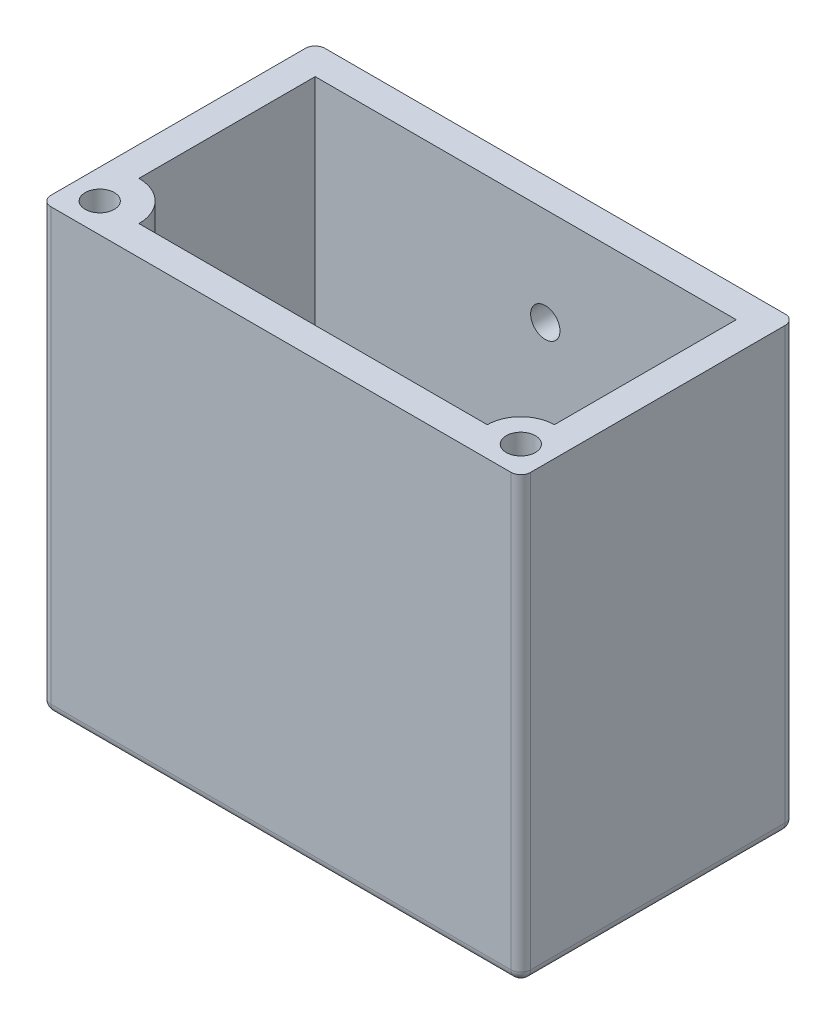
ISO-10303-21;
HEADER;
FILE_DESCRIPTION(('STEP AP214'),'2;1');
FILE_NAME('part.step','',(''),(''),'','','');
FILE_SCHEMA(('AUTOMOTIVE_DESIGN { 1 0 10303 214 1 1 1 1 }'));
ENDSEC;
DATA;
#1=APPLICATION_CONTEXT('core data for automotive mechanical design processes');
#2=APPLICATION_PROTOCOL_DEFINITION('international standard','automotive_design',2000,#1);
#3=PRODUCT_CONTEXT('',#1,'mechanical');
#4=PRODUCT('Part','Part','',(#3));
#5=PRODUCT_RELATED_PRODUCT_CATEGORY('part','',(#4));
#6=PRODUCT_DEFINITION_FORMATION('','',#4);
#7=PRODUCT_DEFINITION_CONTEXT('part definition',#1,'design');
#8=PRODUCT_DEFINITION('design','',#6,#7);
#9=PRODUCT_DEFINITION_SHAPE('','',#8);
#10=(LENGTH_UNIT() NAMED_UNIT(*) SI_UNIT(.MILLI.,.METRE.));
#11=(NAMED_UNIT(*) PLANE_ANGLE_UNIT() SI_UNIT($,.RADIAN.));
#12=(NAMED_UNIT(*) SI_UNIT($,.STERADIAN.) SOLID_ANGLE_UNIT());
#13=UNCERTAINTY_MEASURE_WITH_UNIT(LENGTH_MEASURE(1.E-05),#10,'distance_accuracy_value','');
#14=(GEOMETRIC_REPRESENTATION_CONTEXT(3) GLOBAL_UNCERTAINTY_ASSIGNED_CONTEXT((#13)) GLOBAL_UNIT_ASSIGNED_CONTEXT((#10,
#11,#12)) REPRESENTATION_CONTEXT('',''));
#15=CARTESIAN_POINT('',(0.,0.,0.));
#16=DIRECTION('',(0.,0.,1.));
#17=DIRECTION('',(1.,0.,0.));
#18=AXIS2_PLACEMENT_3D('',#15,#16,#17);
#19=CARTESIAN_POINT('',(-29.4867256637168,45.,-17.2212389380531));
#20=DIRECTION('',(1.,0.,0.));
#21=DIRECTION('',(0.,0.,-1.));
#22=AXIS2_PLACEMENT_3D('',#19,#20,#21);
#23=PLANE('',#22);
#24=DIRECTION('',(0.,0.,1.));
#25=VECTOR('',#24,1.);
#26=CARTESIAN_POINT('',(-29.4867256637168,45.,-17.2212389380531));
#27=LINE('',#26,#25);
#28=CARTESIAN_POINT('',(-29.4867256637168,45.,-16.2212389380531));
#29=VERTEX_POINT('',#28);
#30=CARTESIAN_POINT('',(-29.4867256637168,45.,9.7787610619469));
#31=VERTEX_POINT('',#30);
#32=EDGE_CURVE('E355',#29,#31,#27,.T.);
#33=ORIENTED_EDGE('',*,*,#32,.F.);
#34=DIRECTION('',(0.,-1.,0.));
#35=VECTOR('',#34,1.);
#36=CARTESIAN_POINT('',(-29.4867256637168,45.,-16.2212389380531));
#37=LINE('',#36,#35);
#38=CARTESIAN_POINT('',(-29.4867256637168,1.,-16.2212389380531));
#39=VERTEX_POINT('',#38);
#40=EDGE_CURVE('E240',#29,#39,#37,.T.);
#41=ORIENTED_EDGE('',*,*,#40,.T.);
#42=DIRECTION('',(0.,0.,1.));
#43=VECTOR('',#42,1.);
#44=CARTESIAN_POINT('',(-29.4867256637168,1.,-17.2212389380531));
#45=LINE('',#44,#43);
#46=CARTESIAN_POINT('',(-29.4867256637168,1.,9.77876106194691));
#47=VERTEX_POINT('',#46);
#48=EDGE_CURVE('E238',#39,#47,#45,.T.);
#49=ORIENTED_EDGE('',*,*,#48,.T.);
#50=DIRECTION('',(0.,-1.,0.));
#51=VECTOR('',#50,1.);
#52=CARTESIAN_POINT('',(-29.4867256637168,45.,9.77876106194691));
#53=LINE('',#52,#51);
#54=EDGE_CURVE('E236',#47,#31,#53,.F.);
#55=ORIENTED_EDGE('',*,*,#54,.T.);
#56=EDGE_LOOP('',(#33,#41,#49,#55));
#57=FACE_BOUND('',#56,.T.);
#58=ADVANCED_FACE('F37',(#57),#23,.F.);
#59=CARTESIAN_POINT('',(-29.4867256637168,45.,10.7787610619469));
#60=DIRECTION('',(0.,0.,-1.));
#61=DIRECTION('',(-1.,0.,0.));
#62=AXIS2_PLACEMENT_3D('',#59,#60,#61);
#63=PLANE('',#62);
#64=DIRECTION('',(1.,0.,0.));
#65=VECTOR('',#64,1.);
#66=CARTESIAN_POINT('',(-29.4867256637168,1.,10.7787610619469));
#67=LINE('',#66,#65);
#68=CARTESIAN_POINT('',(-28.4867256637168,1.,10.7787610619469));
#69=VERTEX_POINT('',#68);
#70=CARTESIAN_POINT('',(18.5132743362832,1.,10.7787610619469));
#71=VERTEX_POINT('',#70);
#72=EDGE_CURVE('E53',#69,#71,#67,.T.);
#73=ORIENTED_EDGE('',*,*,#72,.T.);
#74=DIRECTION('',(0.,-1.,0.));
#75=VECTOR('',#74,1.);
#76=CARTESIAN_POINT('',(18.5132743362832,45.,10.7787610619469));
#77=LINE('',#76,#75);
#78=CARTESIAN_POINT('',(18.5132743362832,45.,10.7787610619469));
#79=VERTEX_POINT('',#78);
#80=EDGE_CURVE('E11',#71,#79,#77,.F.);
#81=ORIENTED_EDGE('',*,*,#80,.T.);
#82=DIRECTION('',(1.,0.,0.));
#83=VECTOR('',#82,1.);
#84=CARTESIAN_POINT('',(-29.4867256637168,45.,10.7787610619469));
#85=LINE('',#84,#83);
#86=CARTESIAN_POINT('',(-28.4867256637168,45.,10.7787610619469));
#87=VERTEX_POINT('',#86);
#88=EDGE_CURVE('E360',#87,#79,#85,.T.);
#89=ORIENTED_EDGE('',*,*,#88,.F.);
#90=DIRECTION('',(0.,-1.,0.));
#91=VECTOR('',#90,1.);
#92=CARTESIAN_POINT('',(-28.4867256637168,45.,10.7787610619469));
#93=LINE('',#92,#91);
#94=EDGE_CURVE('E46',#87,#69,#93,.T.);
#95=ORIENTED_EDGE('',*,*,#94,.T.);
#96=EDGE_LOOP('',(#73,#81,#89,#95));
#97=FACE_BOUND('',#96,.T.);
#98=ADVANCED_FACE('F410',(#97),#63,.F.);
#99=CARTESIAN_POINT('',(19.5132743362832,45.,-17.2212389380531));
#100=DIRECTION('',(-1.,0.,0.));
#101=DIRECTION('',(0.,0.,1.));
#102=AXIS2_PLACEMENT_3D('',#99,#100,#101);
#103=PLANE('',#102);
#104=DIRECTION('',(0.,0.,-1.));
#105=VECTOR('',#104,1.);
#106=CARTESIAN_POINT('',(19.5132743362832,1.,-17.2212389380531));
#107=LINE('',#106,#105);
#108=CARTESIAN_POINT('',(19.5132743362832,1.,9.77876106194691));
#109=VERTEX_POINT('',#108);
#110=CARTESIAN_POINT('',(19.5132743362832,1.,-16.2212389380531));
#111=VERTEX_POINT('',#110);
#112=EDGE_CURVE('E202',#109,#111,#107,.T.);
#113=ORIENTED_EDGE('',*,*,#112,.T.);
#114=DIRECTION('',(0.,-1.,0.));
#115=VECTOR('',#114,1.);
#116=CARTESIAN_POINT('',(19.5132743362832,45.,-16.2212389380531));
#117=LINE('',#116,#115);
#118=CARTESIAN_POINT('',(19.5132743362832,45.,-16.2212389380531));
#119=VERTEX_POINT('',#118);
#120=EDGE_CURVE('E211',#111,#119,#117,.F.);
#121=ORIENTED_EDGE('',*,*,#120,.T.);
#122=DIRECTION('',(0.,0.,-1.));
#123=VECTOR('',#122,1.);
#124=CARTESIAN_POINT('',(19.5132743362832,45.,-17.2212389380531));
#125=LINE('',#124,#123);
#126=CARTESIAN_POINT('',(19.5132743362832,45.,9.77876106194691));
#127=VERTEX_POINT('',#126);
#128=EDGE_CURVE('E363',#127,#119,#125,.T.);
#129=ORIENTED_EDGE('',*,*,#128,.F.);
#130=DIRECTION('',(0.,-1.,0.));
#131=VECTOR('',#130,1.);
#132=CARTESIAN_POINT('',(19.5132743362832,45.,9.77876106194691));
#133=LINE('',#132,#131);
#134=EDGE_CURVE('E199',#127,#109,#133,.T.);
#135=ORIENTED_EDGE('',*,*,#134,.T.);
#136=EDGE_LOOP('',(#113,#121,#129,#135));
#137=FACE_BOUND('',#136,.T.);
#138=ADVANCED_FACE('F415',(#137),#103,.F.);
#139=CARTESIAN_POINT('',(-29.4867256637168,45.,-17.2212389380531));
#140=DIRECTION('',(0.,0.,1.));
#141=DIRECTION('',(1.,0.,0.));
#142=AXIS2_PLACEMENT_3D('',#139,#140,#141);
#143=PLANE('',#142);
#144=CARTESIAN_POINT('',(-2.98672566371681,35.,-17.2212389380531));
#145=DIRECTION('',(0.,0.,1.));
#146=DIRECTION('',(1.,0.,0.));
#147=AXIS2_PLACEMENT_3D('',#144,#145,#146);
#148=CIRCLE('',#147,1.5);
#149=CARTESIAN_POINT('',(-1.48672566371681,35.,-17.2212389380531));
#150=VERTEX_POINT('',#149);
#151=EDGE_CURVE('E303',#150,#150,#148,.T.);
#152=ORIENTED_EDGE('',*,*,#151,.T.);
#153=EDGE_LOOP('',(#152));
#154=FACE_BOUND('',#153,.T.);
#155=DIRECTION('',(-1.,0.,0.));
#156=VECTOR('',#155,1.);
#157=CARTESIAN_POINT('',(-29.4867256637168,45.,-17.2212389380531));
#158=LINE('',#157,#156);
#159=CARTESIAN_POINT('',(18.5132743362832,45.,-17.2212389380531));
#160=VERTEX_POINT('',#159);
#161=CARTESIAN_POINT('',(-28.4867256637168,45.,-17.2212389380531));
#162=VERTEX_POINT('',#161);
#163=EDGE_CURVE('E205',#160,#162,#158,.T.);
#164=ORIENTED_EDGE('',*,*,#163,.F.);
#165=DIRECTION('',(0.,-1.,0.));
#166=VECTOR('',#165,1.);
#167=CARTESIAN_POINT('',(18.5132743362832,45.,-17.2212389380531));
#168=LINE('',#167,#166);
#169=CARTESIAN_POINT('',(18.5132743362832,1.,-17.2212389380531));
#170=VERTEX_POINT('',#169);
#171=EDGE_CURVE('E226',#160,#170,#168,.T.);
#172=ORIENTED_EDGE('',*,*,#171,.T.);
#173=DIRECTION('',(-1.,0.,0.));
#174=VECTOR('',#173,1.);
#175=CARTESIAN_POINT('',(-29.4867256637168,1.,-17.2212389380531));
#176=LINE('',#175,#174);
#177=CARTESIAN_POINT('',(-28.4867256637168,1.,-17.2212389380531));
#178=VERTEX_POINT('',#177);
#179=EDGE_CURVE('E224',#170,#178,#176,.T.);
#180=ORIENTED_EDGE('',*,*,#179,.T.);
#181=DIRECTION('',(0.,-1.,0.));
#182=VECTOR('',#181,1.);
#183=CARTESIAN_POINT('',(-28.4867256637168,45.,-17.2212389380531));
#184=LINE('',#183,#182);
#185=EDGE_CURVE('E222',#178,#162,#184,.F.);
#186=ORIENTED_EDGE('',*,*,#185,.T.);
#187=EDGE_LOOP('',(#164,#172,#180,#186));
#188=FACE_BOUND('',#187,.T.);
#189=ADVANCED_FACE('F540',(#154,#188),#143,.F.);
#190=CARTESIAN_POINT('',(0.,45.,0.));
#191=DIRECTION('',(0.,1.,0.));
#192=DIRECTION('',(0.,0.,1.));
#193=AXIS2_PLACEMENT_3D('',#190,#191,#192);
#194=PLANE('',#193);
#195=CARTESIAN_POINT('',(-26.4867256637168,45.,7.77876106194691));
#196=DIRECTION('',(0.,-1.,0.));
#197=DIRECTION('',(0.,0.,-1.));
#198=AXIS2_PLACEMENT_3D('',#195,#196,#197);
#199=CIRCLE('',#198,1.49);
#200=CARTESIAN_POINT('',(-26.4867256637168,45.,6.28876106194691));
#201=VERTEX_POINT('',#200);
#202=EDGE_CURVE('E279',#201,#201,#199,.T.);
#203=ORIENTED_EDGE('',*,*,#202,.T.);
#204=EDGE_LOOP('',(#203));
#205=FACE_BOUND('',#204,.T.);
#206=DIRECTION('',(1.,0.,0.));
#207=VECTOR('',#206,1.);
#208=CARTESIAN_POINT('',(16.5132743362832,45.,7.77876106194691));
#209=LINE('',#208,#207);
#210=CARTESIAN_POINT('',(-22.4867256637168,45.,7.77876106194691));
#211=VERTEX_POINT('',#210);
#212=CARTESIAN_POINT('',(13.0915061708648,45.,7.77876106194691));
#213=VERTEX_POINT('',#212);
#214=EDGE_CURVE('E343',#211,#213,#209,.T.);
#215=ORIENTED_EDGE('',*,*,#214,.F.);
#216=CARTESIAN_POINT('',(-26.4867256637168,45.,7.77876106194691));
#217=DIRECTION('',(0.,-1.,0.));
#218=DIRECTION('',(0.,0.,-1.));
#219=AXIS2_PLACEMENT_3D('',#216,#217,#218);
#220=CIRCLE('',#219,4.);
#221=CARTESIAN_POINT('',(-26.4867256637168,45.,3.77876106194691));
#222=VERTEX_POINT('',#221);
#223=EDGE_CURVE('E195',#222,#211,#220,.T.);
#224=ORIENTED_EDGE('',*,*,#223,.F.);
#225=DIRECTION('',(0.,0.,1.));
#226=VECTOR('',#225,1.);
#227=CARTESIAN_POINT('',(-26.4867256637168,45.,7.77876106194691));
#228=LINE('',#227,#226);
#229=CARTESIAN_POINT('',(-26.4867256637168,45.,-14.2212389380531));
#230=VERTEX_POINT('',#229);
#231=EDGE_CURVE('E190',#230,#222,#228,.T.);
#232=ORIENTED_EDGE('',*,*,#231,.F.);
#233=DIRECTION('',(-1.,0.,0.));
#234=VECTOR('',#233,1.);
#235=CARTESIAN_POINT('',(16.5132743362832,45.,-14.2212389380531));
#236=LINE('',#235,#234);
#237=CARTESIAN_POINT('',(16.5132743362832,45.,-14.2212389380531));
#238=VERTEX_POINT('',#237);
#239=EDGE_CURVE('E348',#238,#230,#236,.T.);
#240=ORIENTED_EDGE('',*,*,#239,.F.);
#241=DIRECTION('',(0.,0.,-1.));
#242=VECTOR('',#241,1.);
#243=CARTESIAN_POINT('',(16.5132743362832,45.,7.77876106194691));
#244=LINE('',#243,#242);
#245=CARTESIAN_POINT('',(16.5132743362832,45.,4.35699289652851));
#246=VERTEX_POINT('',#245);
#247=EDGE_CURVE('E340',#246,#238,#244,.T.);
#248=ORIENTED_EDGE('',*,*,#247,.F.);
#249=CARTESIAN_POINT('',(16.5132743362832,45.,7.77876106194691));
#250=DIRECTION('',(0.,-1.,0.));
#251=DIRECTION('',(0.,0.,-1.));
#252=AXIS2_PLACEMENT_3D('',#249,#250,#251);
#253=CIRCLE('',#252,3.4217681654184);
#254=EDGE_CURVE('E292',#213,#246,#253,.T.);
#255=ORIENTED_EDGE('',*,*,#254,.F.);
#256=EDGE_LOOP('',(#215,#224,#232,#240,#248,#255));
#257=FACE_BOUND('',#256,.T.);
#258=ORIENTED_EDGE('',*,*,#128,.T.);
#259=CARTESIAN_POINT('',(18.5132743362832,45.,-16.2212389380531));
#260=DIRECTION('',(0.,1.,0.));
#261=DIRECTION('',(0.,0.,1.));
#262=AXIS2_PLACEMENT_3D('',#259,#260,#261);
#263=CIRCLE('',#262,1.);
#264=EDGE_CURVE('E234',#119,#160,#263,.T.);
#265=ORIENTED_EDGE('',*,*,#264,.T.);
#266=ORIENTED_EDGE('',*,*,#163,.T.);
#267=CARTESIAN_POINT('',(-28.4867256637168,45.,-16.2212389380531));
#268=DIRECTION('',(0.,1.,0.));
#269=DIRECTION('',(0.,0.,1.));
#270=AXIS2_PLACEMENT_3D('',#267,#268,#269);
#271=CIRCLE('',#270,1.);
#272=EDGE_CURVE('E232',#162,#29,#271,.T.);
#273=ORIENTED_EDGE('',*,*,#272,.T.);
#274=ORIENTED_EDGE('',*,*,#32,.T.);
#275=CARTESIAN_POINT('',(-28.4867256637168,45.,9.77876106194691));
#276=DIRECTION('',(0.,1.,0.));
#277=DIRECTION('',(0.,0.,1.));
#278=AXIS2_PLACEMENT_3D('',#275,#276,#277);
#279=CIRCLE('',#278,1.);
#280=EDGE_CURVE('E228',#31,#87,#279,.T.);
#281=ORIENTED_EDGE('',*,*,#280,.T.);
#282=ORIENTED_EDGE('',*,*,#88,.T.);
#283=CARTESIAN_POINT('',(18.5132743362832,45.,9.77876106194691));
#284=DIRECTION('',(0.,1.,0.));
#285=DIRECTION('',(0.,0.,1.));
#286=AXIS2_PLACEMENT_3D('',#283,#284,#285);
#287=CIRCLE('',#286,1.);
#288=EDGE_CURVE('E230',#79,#127,#287,.T.);
#289=ORIENTED_EDGE('',*,*,#288,.T.);
#290=EDGE_LOOP('',(#258,#265,#266,#273,#274,#281,#282,#289));
#291=FACE_BOUND('',#290,.T.);
#292=CARTESIAN_POINT('',(16.5132743362832,45.,7.77876106194691));
#293=DIRECTION('',(0.,-1.,0.));
#294=DIRECTION('',(0.,0.,-1.));
#295=AXIS2_PLACEMENT_3D('',#292,#293,#294);
#296=CIRCLE('',#295,1.49);
#297=CARTESIAN_POINT('',(16.5132743362832,45.,6.28876106194691));
#298=VERTEX_POINT('',#297);
#299=EDGE_CURVE('E289',#298,#298,#296,.T.);
#300=ORIENTED_EDGE('',*,*,#299,.T.);
#301=EDGE_LOOP('',(#300));
#302=FACE_BOUND('',#301,.T.);
#303=ADVANCED_FACE('F369',(#205,#257,#291,#302),#194,.T.);
#304=CARTESIAN_POINT('',(0.,0.,0.));
#305=DIRECTION('',(0.,1.,0.));
#306=DIRECTION('',(0.,0.,1.));
#307=AXIS2_PLACEMENT_3D('',#304,#305,#306);
#308=PLANE('',#307);
#309=DIRECTION('',(-1.,0.,0.));
#310=VECTOR('',#309,1.);
#311=CARTESIAN_POINT('',(0.,0.,-16.2212389380531));
#312=LINE('',#311,#310);
#313=CARTESIAN_POINT('',(-28.4867256637168,0.,-16.2212389380531));
#314=VERTEX_POINT('',#313);
#315=CARTESIAN_POINT('',(18.5132743362832,0.,-16.2212389380531));
#316=VERTEX_POINT('',#315);
#317=EDGE_CURVE('E217',#314,#316,#312,.F.);
#318=ORIENTED_EDGE('',*,*,#317,.T.);
#319=DIRECTION('',(0.,0.,-1.));
#320=VECTOR('',#319,1.);
#321=CARTESIAN_POINT('',(18.5132743362832,0.,0.));
#322=LINE('',#321,#320);
#323=CARTESIAN_POINT('',(18.5132743362832,0.,9.77876106194691));
#324=VERTEX_POINT('',#323);
#325=EDGE_CURVE('E219',#316,#324,#322,.F.);
#326=ORIENTED_EDGE('',*,*,#325,.T.);
#327=DIRECTION('',(1.,0.,0.));
#328=VECTOR('',#327,1.);
#329=CARTESIAN_POINT('',(0.,0.,9.77876106194691));
#330=LINE('',#329,#328);
#331=CARTESIAN_POINT('',(-28.4867256637168,0.,9.77876106194691));
#332=VERTEX_POINT('',#331);
#333=EDGE_CURVE('E213',#324,#332,#330,.F.);
#334=ORIENTED_EDGE('',*,*,#333,.T.);
#335=DIRECTION('',(0.,0.,1.));
#336=VECTOR('',#335,1.);
#337=CARTESIAN_POINT('',(-28.4867256637168,0.,0.));
#338=LINE('',#337,#336);
#339=EDGE_CURVE('E215',#332,#314,#338,.F.);
#340=ORIENTED_EDGE('',*,*,#339,.T.);
#341=EDGE_LOOP('',(#318,#326,#334,#340));
#342=FACE_BOUND('',#341,.T.);
#343=CARTESIAN_POINT('',(-26.4867256637168,0.,7.77876106194691));
#344=DIRECTION('',(0.,-1.,0.));
#345=DIRECTION('',(0.,0.,-1.));
#346=AXIS2_PLACEMENT_3D('',#343,#344,#345);
#347=CIRCLE('',#346,1.49);
#348=CARTESIAN_POINT('',(-26.4867256637168,0.,6.28876106194691));
#349=VERTEX_POINT('',#348);
#350=EDGE_CURVE('E276',#349,#349,#347,.T.);
#351=ORIENTED_EDGE('',*,*,#350,.F.);
#352=EDGE_LOOP('',(#351));
#353=FACE_BOUND('',#352,.T.);
#354=CARTESIAN_POINT('',(16.5132743362832,0.,7.77876106194691));
#355=DIRECTION('',(0.,-1.,0.));
#356=DIRECTION('',(0.,0.,-1.));
#357=AXIS2_PLACEMENT_3D('',#354,#355,#356);
#358=CIRCLE('',#357,1.49);
#359=CARTESIAN_POINT('',(16.5132743362832,0.,6.28876106194691));
#360=VERTEX_POINT('',#359);
#361=EDGE_CURVE('E288',#360,#360,#358,.T.);
#362=ORIENTED_EDGE('',*,*,#361,.F.);
#363=EDGE_LOOP('',(#362));
#364=FACE_BOUND('',#363,.T.);
#365=DIRECTION('',(1.,0.,0.));
#366=VECTOR('',#365,1.);
#367=CARTESIAN_POINT('',(0.,0.,-3.22123893805309));
#368=LINE('',#367,#366);
#369=CARTESIAN_POINT('',(-19.4867256637168,0.,-3.22123893805309));
#370=VERTEX_POINT('',#369);
#371=CARTESIAN_POINT('',(9.51327433628319,0.,-3.22123893805309));
#372=VERTEX_POINT('',#371);
#373=EDGE_CURVE('E334',#370,#372,#368,.T.);
#374=ORIENTED_EDGE('',*,*,#373,.T.);
#375=DIRECTION('',(0.,0.,-1.));
#376=VECTOR('',#375,1.);
#377=CARTESIAN_POINT('',(9.51327433628319,0.,0.));
#378=LINE('',#377,#376);
#379=CARTESIAN_POINT('',(9.51327433628319,0.,-11.2212389380531));
#380=VERTEX_POINT('',#379);
#381=EDGE_CURVE('E337',#372,#380,#378,.T.);
#382=ORIENTED_EDGE('',*,*,#381,.T.);
#383=DIRECTION('',(-1.,0.,0.));
#384=VECTOR('',#383,1.);
#385=CARTESIAN_POINT('',(0.,0.,-11.2212389380531));
#386=LINE('',#385,#384);
#387=CARTESIAN_POINT('',(-19.4867256637168,0.,-11.2212389380531));
#388=VERTEX_POINT('',#387);
#389=EDGE_CURVE('E322',#380,#388,#386,.T.);
#390=ORIENTED_EDGE('',*,*,#389,.T.);
#391=DIRECTION('',(0.,0.,1.));
#392=VECTOR('',#391,1.);
#393=CARTESIAN_POINT('',(-19.4867256637168,0.,0.));
#394=LINE('',#393,#392);
#395=EDGE_CURVE('E331',#388,#370,#394,.T.);
#396=ORIENTED_EDGE('',*,*,#395,.T.);
#397=EDGE_LOOP('',(#374,#382,#390,#396));
#398=FACE_BOUND('',#397,.T.);
#399=ADVANCED_FACE('F389',(#342,#353,#364,#398),#308,.F.);
#400=CARTESIAN_POINT('',(16.5132743362832,2.,7.77876106194691));
#401=DIRECTION('',(1.,0.,0.));
#402=DIRECTION('',(0.,0.,-1.));
#403=AXIS2_PLACEMENT_3D('',#400,#401,#402);
#404=PLANE('',#403);
#405=DIRECTION('',(0.,0.,-1.));
#406=VECTOR('',#405,1.);
#407=CARTESIAN_POINT('',(16.5132743362832,2.,7.77876106194691));
#408=LINE('',#407,#406);
#409=CARTESIAN_POINT('',(16.5132743362832,2.,4.35699289652851));
#410=VERTEX_POINT('',#409);
#411=CARTESIAN_POINT('',(16.5132743362832,2.,-14.2212389380531));
#412=VERTEX_POINT('',#411);
#413=EDGE_CURVE('E341',#410,#412,#408,.T.);
#414=ORIENTED_EDGE('',*,*,#413,.F.);
#415=DIRECTION('',(0.,-1.,0.));
#416=VECTOR('',#415,1.);
#417=CARTESIAN_POINT('',(16.5132743362832,45.,4.35699289652851));
#418=LINE('',#417,#416);
#419=EDGE_CURVE('E300',#410,#246,#418,.F.);
#420=ORIENTED_EDGE('',*,*,#419,.T.);
#421=ORIENTED_EDGE('',*,*,#247,.T.);
#422=DIRECTION('',(0.,1.,0.));
#423=VECTOR('',#422,1.);
#424=CARTESIAN_POINT('',(16.5132743362832,2.,-14.2212389380531));
#425=LINE('',#424,#423);
#426=EDGE_CURVE('E346',#412,#238,#425,.T.);
#427=ORIENTED_EDGE('',*,*,#426,.F.);
#428=EDGE_LOOP('',(#414,#420,#421,#427));
#429=FACE_BOUND('',#428,.T.);
#430=ADVANCED_FACE('F570',(#429),#404,.F.);
#431=CARTESIAN_POINT('',(16.5132743362832,2.,7.77876106194691));
#432=DIRECTION('',(0.,0.,1.));
#433=DIRECTION('',(1.,0.,0.));
#434=AXIS2_PLACEMENT_3D('',#431,#432,#433);
#435=PLANE('',#434);
#436=DIRECTION('',(1.,0.,0.));
#437=VECTOR('',#436,1.);
#438=CARTESIAN_POINT('',(16.5132743362832,2.,7.77876106194691));
#439=LINE('',#438,#437);
#440=CARTESIAN_POINT('',(-22.4867256637168,2.,7.77876106194691));
#441=VERTEX_POINT('',#440);
#442=CARTESIAN_POINT('',(13.0915061708648,2.,7.77876106194691));
#443=VERTEX_POINT('',#442);
#444=EDGE_CURVE('E184',#441,#443,#439,.T.);
#445=ORIENTED_EDGE('',*,*,#444,.F.);
#446=DIRECTION('',(0.,-1.,0.));
#447=VECTOR('',#446,1.);
#448=CARTESIAN_POINT('',(-22.4867256637168,45.,7.77876106194691));
#449=LINE('',#448,#447);
#450=EDGE_CURVE('E194',#441,#211,#449,.F.);
#451=ORIENTED_EDGE('',*,*,#450,.T.);
#452=ORIENTED_EDGE('',*,*,#214,.T.);
#453=DIRECTION('',(0.,-1.,0.));
#454=VECTOR('',#453,1.);
#455=CARTESIAN_POINT('',(13.0915061708648,45.,7.77876106194691));
#456=LINE('',#455,#454);
#457=EDGE_CURVE('E297',#213,#443,#456,.T.);
#458=ORIENTED_EDGE('',*,*,#457,.T.);
#459=EDGE_LOOP('',(#445,#451,#452,#458));
#460=FACE_BOUND('',#459,.T.);
#461=ADVANCED_FACE('F575',(#460),#435,.F.);
#462=CARTESIAN_POINT('',(-26.4867256637168,2.,7.77876106194691));
#463=DIRECTION('',(-1.,0.,0.));
#464=DIRECTION('',(0.,0.,1.));
#465=AXIS2_PLACEMENT_3D('',#462,#463,#464);
#466=PLANE('',#465);
#467=ORIENTED_EDGE('',*,*,#231,.T.);
#468=DIRECTION('',(0.,-1.,0.));
#469=VECTOR('',#468,1.);
#470=CARTESIAN_POINT('',(-26.4867256637168,45.,3.77876106194691));
#471=LINE('',#470,#469);
#472=CARTESIAN_POINT('',(-26.4867256637168,2.,3.77876106194691));
#473=VERTEX_POINT('',#472);
#474=EDGE_CURVE('E187',#222,#473,#471,.T.);
#475=ORIENTED_EDGE('',*,*,#474,.T.);
#476=DIRECTION('',(0.,0.,1.));
#477=VECTOR('',#476,1.);
#478=CARTESIAN_POINT('',(-26.4867256637168,2.,7.77876106194691));
#479=LINE('',#478,#477);
#480=CARTESIAN_POINT('',(-26.4867256637168,2.,-14.2212389380531));
#481=VERTEX_POINT('',#480);
#482=EDGE_CURVE('E174',#481,#473,#479,.T.);
#483=ORIENTED_EDGE('',*,*,#482,.F.);
#484=DIRECTION('',(0.,1.,0.));
#485=VECTOR('',#484,1.);
#486=CARTESIAN_POINT('',(-26.4867256637168,2.,-14.2212389380531));
#487=LINE('',#486,#485);
#488=EDGE_CURVE('E353',#481,#230,#487,.T.);
#489=ORIENTED_EDGE('',*,*,#488,.T.);
#490=EDGE_LOOP('',(#467,#475,#483,#489));
#491=FACE_BOUND('',#490,.T.);
#492=ADVANCED_FACE('F188',(#491),#466,.F.);
#493=CARTESIAN_POINT('',(16.5132743362832,2.,-14.2212389380531));
#494=DIRECTION('',(0.,0.,-1.));
#495=DIRECTION('',(-1.,0.,0.));
#496=AXIS2_PLACEMENT_3D('',#493,#494,#495);
#497=PLANE('',#496);
#498=CARTESIAN_POINT('',(-2.98672566371681,35.,-14.2212389380531));
#499=DIRECTION('',(0.,0.,1.));
#500=DIRECTION('',(1.,0.,0.));
#501=AXIS2_PLACEMENT_3D('',#498,#499,#500);
#502=CIRCLE('',#501,1.5);
#503=CARTESIAN_POINT('',(-1.48672566371681,35.,-14.2212389380531));
#504=VERTEX_POINT('',#503);
#505=EDGE_CURVE('E302',#504,#504,#502,.T.);
#506=ORIENTED_EDGE('',*,*,#505,.F.);
#507=EDGE_LOOP('',(#506));
#508=FACE_BOUND('',#507,.T.);
#509=ORIENTED_EDGE('',*,*,#239,.T.);
#510=ORIENTED_EDGE('',*,*,#488,.F.);
#511=DIRECTION('',(-1.,0.,0.));
#512=VECTOR('',#511,1.);
#513=CARTESIAN_POINT('',(16.5132743362832,2.,-14.2212389380531));
#514=LINE('',#513,#512);
#515=EDGE_CURVE('E182',#412,#481,#514,.T.);
#516=ORIENTED_EDGE('',*,*,#515,.F.);
#517=ORIENTED_EDGE('',*,*,#426,.T.);
#518=EDGE_LOOP('',(#509,#510,#516,#517));
#519=FACE_BOUND('',#518,.T.);
#520=ADVANCED_FACE('F595',(#508,#519),#497,.F.);
#521=CARTESIAN_POINT('',(0.,2.,0.));
#522=DIRECTION('',(0.,1.,0.));
#523=DIRECTION('',(0.,0.,1.));
#524=AXIS2_PLACEMENT_3D('',#521,#522,#523);
#525=PLANE('',#524);
#526=CARTESIAN_POINT('',(-26.4867256637168,2.,7.77876106194691));
#527=DIRECTION('',(0.,1.,0.));
#528=DIRECTION('',(0.,0.,1.));
#529=AXIS2_PLACEMENT_3D('',#526,#527,#528);
#530=CIRCLE('',#529,4.);
#531=EDGE_CURVE('E179',#441,#473,#530,.T.);
#532=ORIENTED_EDGE('',*,*,#531,.F.);
#533=ORIENTED_EDGE('',*,*,#444,.T.);
#534=CARTESIAN_POINT('',(16.5132743362832,2.,7.77876106194691));
#535=DIRECTION('',(0.,1.,0.));
#536=DIRECTION('',(0.,0.,1.));
#537=AXIS2_PLACEMENT_3D('',#534,#535,#536);
#538=CIRCLE('',#537,3.4217681654184);
#539=EDGE_CURVE('E200',#410,#443,#538,.T.);
#540=ORIENTED_EDGE('',*,*,#539,.F.);
#541=ORIENTED_EDGE('',*,*,#413,.T.);
#542=ORIENTED_EDGE('',*,*,#515,.T.);
#543=ORIENTED_EDGE('',*,*,#482,.T.);
#544=EDGE_LOOP('',(#532,#533,#540,#541,#542,#543));
#545=FACE_BOUND('',#544,.T.);
#546=DIRECTION('',(0.,0.,-1.));
#547=VECTOR('',#546,1.);
#548=CARTESIAN_POINT('',(9.51327433628319,2.,-3.22123893805309));
#549=LINE('',#548,#547);
#550=CARTESIAN_POINT('',(9.51327433628319,2.,-3.22123893805309));
#551=VERTEX_POINT('',#550);
#552=CARTESIAN_POINT('',(9.51327433628319,2.,-11.2212389380531));
#553=VERTEX_POINT('',#552);
#554=EDGE_CURVE('E306',#551,#553,#549,.T.);
#555=ORIENTED_EDGE('',*,*,#554,.F.);
#556=DIRECTION('',(1.,0.,0.));
#557=VECTOR('',#556,1.);
#558=CARTESIAN_POINT('',(9.51327433628319,2.,-3.22123893805309));
#559=LINE('',#558,#557);
#560=CARTESIAN_POINT('',(-19.4867256637168,2.,-3.22123893805309));
#561=VERTEX_POINT('',#560);
#562=EDGE_CURVE('E316',#561,#551,#559,.T.);
#563=ORIENTED_EDGE('',*,*,#562,.F.);
#564=DIRECTION('',(0.,0.,1.));
#565=VECTOR('',#564,1.);
#566=CARTESIAN_POINT('',(-19.4867256637168,2.,-3.22123893805309));
#567=LINE('',#566,#565);
#568=CARTESIAN_POINT('',(-19.4867256637168,2.,-11.2212389380531));
#569=VERTEX_POINT('',#568);
#570=EDGE_CURVE('E313',#569,#561,#567,.T.);
#571=ORIENTED_EDGE('',*,*,#570,.F.);
#572=DIRECTION('',(-1.,0.,0.));
#573=VECTOR('',#572,1.);
#574=CARTESIAN_POINT('',(9.51327433628319,2.,-11.2212389380531));
#575=LINE('',#574,#573);
#576=EDGE_CURVE('E310',#553,#569,#575,.T.);
#577=ORIENTED_EDGE('',*,*,#576,.F.);
#578=EDGE_LOOP('',(#555,#563,#571,#577));
#579=FACE_BOUND('',#578,.T.);
#580=ADVANCED_FACE('F176',(#545,#579),#525,.T.);
#581=CARTESIAN_POINT('',(9.51327433628319,-0.999999999999998,-3.22123893805309));
#582=DIRECTION('',(1.,0.,0.));
#583=DIRECTION('',(0.,0.,-1.));
#584=AXIS2_PLACEMENT_3D('',#581,#582,#583);
#585=PLANE('',#584);
#586=DIRECTION('',(0.,1.,0.));
#587=VECTOR('',#586,1.);
#588=CARTESIAN_POINT('',(9.51327433628319,-0.999999999999998,-3.22123893805309));
#589=LINE('',#588,#587);
#590=EDGE_CURVE('E320',#372,#551,#589,.T.);
#591=ORIENTED_EDGE('',*,*,#590,.T.);
#592=ORIENTED_EDGE('',*,*,#554,.T.);
#593=DIRECTION('',(0.,1.,0.));
#594=VECTOR('',#593,1.);
#595=CARTESIAN_POINT('',(9.51327433628319,-0.999999999999998,-11.2212389380531));
#596=LINE('',#595,#594);
#597=EDGE_CURVE('E319',#380,#553,#596,.T.);
#598=ORIENTED_EDGE('',*,*,#597,.F.);
#599=ORIENTED_EDGE('',*,*,#381,.F.);
#600=EDGE_LOOP('',(#591,#592,#598,#599));
#601=FACE_BOUND('',#600,.T.);
#602=ADVANCED_FACE('F631',(#601),#585,.F.);
#603=CARTESIAN_POINT('',(9.51327433628319,-0.999999999999998,-3.22123893805309));
#604=DIRECTION('',(0.,0.,1.));
#605=DIRECTION('',(1.,0.,0.));
#606=AXIS2_PLACEMENT_3D('',#603,#604,#605);
#607=PLANE('',#606);
#608=DIRECTION('',(0.,1.,0.));
#609=VECTOR('',#608,1.);
#610=CARTESIAN_POINT('',(-19.4867256637168,-0.999999999999998,-3.22123893805309));
#611=LINE('',#610,#609);
#612=EDGE_CURVE('E323',#370,#561,#611,.T.);
#613=ORIENTED_EDGE('',*,*,#612,.T.);
#614=ORIENTED_EDGE('',*,*,#562,.T.);
#615=ORIENTED_EDGE('',*,*,#590,.F.);
#616=ORIENTED_EDGE('',*,*,#373,.F.);
#617=EDGE_LOOP('',(#613,#614,#615,#616));
#618=FACE_BOUND('',#617,.T.);
#619=ADVANCED_FACE('F621',(#618),#607,.F.);
#620=CARTESIAN_POINT('',(-19.4867256637168,-0.999999999999998,-3.22123893805309));
#621=DIRECTION('',(-1.,0.,0.));
#622=DIRECTION('',(0.,0.,1.));
#623=AXIS2_PLACEMENT_3D('',#620,#621,#622);
#624=PLANE('',#623);
#625=DIRECTION('',(0.,1.,0.));
#626=VECTOR('',#625,1.);
#627=CARTESIAN_POINT('',(-19.4867256637168,-0.999999999999998,-11.2212389380531));
#628=LINE('',#627,#626);
#629=EDGE_CURVE('E325',#388,#569,#628,.T.);
#630=ORIENTED_EDGE('',*,*,#629,.T.);
#631=ORIENTED_EDGE('',*,*,#570,.T.);
#632=ORIENTED_EDGE('',*,*,#612,.F.);
#633=ORIENTED_EDGE('',*,*,#395,.F.);
#634=EDGE_LOOP('',(#630,#631,#632,#633));
#635=FACE_BOUND('',#634,.T.);
#636=ADVANCED_FACE('F611',(#635),#624,.F.);
#637=CARTESIAN_POINT('',(9.51327433628319,-0.999999999999998,-11.2212389380531));
#638=DIRECTION('',(0.,0.,-1.));
#639=DIRECTION('',(-1.,0.,0.));
#640=AXIS2_PLACEMENT_3D('',#637,#638,#639);
#641=PLANE('',#640);
#642=ORIENTED_EDGE('',*,*,#597,.T.);
#643=ORIENTED_EDGE('',*,*,#576,.T.);
#644=ORIENTED_EDGE('',*,*,#629,.F.);
#645=ORIENTED_EDGE('',*,*,#389,.F.);
#646=EDGE_LOOP('',(#642,#643,#644,#645));
#647=FACE_BOUND('',#646,.T.);
#648=ADVANCED_FACE('F587',(#647),#641,.F.);
#649=CARTESIAN_POINT('',(-2.98672566371681,35.,-17.2212389380531));
#650=DIRECTION('',(0.,0.,1.));
#651=DIRECTION('',(1.,0.,0.));
#652=AXIS2_PLACEMENT_3D('',#649,#650,#651);
#653=CYLINDRICAL_SURFACE('',#652,1.5);
#654=ORIENTED_EDGE('',*,*,#151,.F.);
#655=EDGE_LOOP('',(#654));
#656=FACE_BOUND('',#655,.T.);
#657=ORIENTED_EDGE('',*,*,#505,.T.);
#658=EDGE_LOOP('',(#657));
#659=FACE_BOUND('',#658,.T.);
#660=ADVANCED_FACE('F563',(#656,#659),#653,.F.);
#661=CARTESIAN_POINT('',(16.5132743362832,45.,7.77876106194691));
#662=DIRECTION('',(0.,-1.,0.));
#663=DIRECTION('',(0.,0.,-1.));
#664=AXIS2_PLACEMENT_3D('',#661,#662,#663);
#665=CYLINDRICAL_SURFACE('',#664,3.4217681654184);
#666=ORIENTED_EDGE('',*,*,#419,.F.);
#667=ORIENTED_EDGE('',*,*,#539,.T.);
#668=ORIENTED_EDGE('',*,*,#457,.F.);
#669=ORIENTED_EDGE('',*,*,#254,.T.);
#670=EDGE_LOOP('',(#666,#667,#668,#669));
#671=FACE_BOUND('',#670,.T.);
#672=ADVANCED_FACE('F554',(#671),#665,.T.);
#673=CARTESIAN_POINT('',(16.5132743362832,45.,7.77876106194691));
#674=DIRECTION('',(0.,-1.,0.));
#675=DIRECTION('',(0.,0.,-1.));
#676=AXIS2_PLACEMENT_3D('',#673,#674,#675);
#677=CYLINDRICAL_SURFACE('',#676,1.49);
#678=ORIENTED_EDGE('',*,*,#299,.F.);
#679=EDGE_LOOP('',(#678));
#680=FACE_BOUND('',#679,.T.);
#681=ORIENTED_EDGE('',*,*,#361,.T.);
#682=EDGE_LOOP('',(#681));
#683=FACE_BOUND('',#682,.T.);
#684=ADVANCED_FACE('F530',(#680,#683),#677,.F.);
#685=CARTESIAN_POINT('',(-26.4867256637168,45.,7.77876106194691));
#686=DIRECTION('',(0.,-1.,0.));
#687=DIRECTION('',(0.,0.,-1.));
#688=AXIS2_PLACEMENT_3D('',#685,#686,#687);
#689=CYLINDRICAL_SURFACE('',#688,4.);
#690=ORIENTED_EDGE('',*,*,#450,.F.);
#691=ORIENTED_EDGE('',*,*,#531,.T.);
#692=ORIENTED_EDGE('',*,*,#474,.F.);
#693=ORIENTED_EDGE('',*,*,#223,.T.);
#694=EDGE_LOOP('',(#690,#691,#692,#693));
#695=FACE_BOUND('',#694,.T.);
#696=ADVANCED_FACE('F198',(#695),#689,.T.);
#697=CARTESIAN_POINT('',(-26.4867256637168,45.,7.77876106194691));
#698=DIRECTION('',(0.,-1.,0.));
#699=DIRECTION('',(0.,0.,-1.));
#700=AXIS2_PLACEMENT_3D('',#697,#698,#699);
#701=CYLINDRICAL_SURFACE('',#700,1.49);
#702=ORIENTED_EDGE('',*,*,#202,.F.);
#703=EDGE_LOOP('',(#702));
#704=FACE_BOUND('',#703,.T.);
#705=ORIENTED_EDGE('',*,*,#350,.T.);
#706=EDGE_LOOP('',(#705));
#707=FACE_BOUND('',#706,.T.);
#708=ADVANCED_FACE('F513',(#704,#707),#701,.F.);
#709=CARTESIAN_POINT('',(-28.4867256637168,45.,9.77876106194691));
#710=DIRECTION('',(0.,-1.,0.));
#711=DIRECTION('',(0.,0.,-1.));
#712=AXIS2_PLACEMENT_3D('',#709,#710,#711);
#713=CYLINDRICAL_SURFACE('',#712,1.);
#714=ORIENTED_EDGE('',*,*,#280,.F.);
#715=ORIENTED_EDGE('',*,*,#54,.F.);
#716=CARTESIAN_POINT('',(-28.4867256637168,1.,9.77876106194691));
#717=DIRECTION('',(0.,-1.,0.));
#718=DIRECTION('',(0.,0.,-1.));
#719=AXIS2_PLACEMENT_3D('',#716,#717,#718);
#720=CIRCLE('',#719,1.);
#721=EDGE_CURVE('E271',#69,#47,#720,.T.);
#722=ORIENTED_EDGE('',*,*,#721,.F.);
#723=ORIENTED_EDGE('',*,*,#94,.F.);
#724=EDGE_LOOP('',(#714,#715,#722,#723));
#725=FACE_BOUND('',#724,.T.);
#726=ADVANCED_FACE('F39',(#725),#713,.T.);
#727=CARTESIAN_POINT('',(-28.4867256637168,45.,-16.2212389380531));
#728=DIRECTION('',(0.,-1.,0.));
#729=DIRECTION('',(0.,0.,-1.));
#730=AXIS2_PLACEMENT_3D('',#727,#728,#729);
#731=CYLINDRICAL_SURFACE('',#730,1.);
#732=ORIENTED_EDGE('',*,*,#272,.F.);
#733=ORIENTED_EDGE('',*,*,#185,.F.);
#734=CARTESIAN_POINT('',(-28.4867256637168,1.,-16.2212389380531));
#735=DIRECTION('',(0.,-1.,0.));
#736=DIRECTION('',(0.,0.,-1.));
#737=AXIS2_PLACEMENT_3D('',#734,#735,#736);
#738=CIRCLE('',#737,1.);
#739=EDGE_CURVE('E269',#39,#178,#738,.T.);
#740=ORIENTED_EDGE('',*,*,#739,.F.);
#741=ORIENTED_EDGE('',*,*,#40,.F.);
#742=EDGE_LOOP('',(#732,#733,#740,#741));
#743=FACE_BOUND('',#742,.T.);
#744=ADVANCED_FACE('F378',(#743),#731,.T.);
#745=CARTESIAN_POINT('',(-28.4867256637168,1.,-17.2212389380531));
#746=DIRECTION('',(0.,0.,1.));
#747=DIRECTION('',(1.,0.,0.));
#748=AXIS2_PLACEMENT_3D('',#745,#746,#747);
#749=CYLINDRICAL_SURFACE('',#748,1.);
#750=CARTESIAN_POINT('',(-28.4867256637168,1.,9.77876106194691));
#751=DIRECTION('',(0.,0.,1.));
#752=DIRECTION('',(1.,0.,0.));
#753=AXIS2_PLACEMENT_3D('',#750,#751,#752);
#754=CIRCLE('',#753,1.);
#755=EDGE_CURVE('E41',#47,#332,#754,.T.);
#756=ORIENTED_EDGE('',*,*,#755,.F.);
#757=ORIENTED_EDGE('',*,*,#48,.F.);
#758=CARTESIAN_POINT('',(-28.4867256637168,1.,-16.2212389380531));
#759=DIRECTION('',(0.,0.,-1.));
#760=DIRECTION('',(-1.,0.,0.));
#761=AXIS2_PLACEMENT_3D('',#758,#759,#760);
#762=CIRCLE('',#761,1.);
#763=EDGE_CURVE('E266',#314,#39,#762,.T.);
#764=ORIENTED_EDGE('',*,*,#763,.F.);
#765=ORIENTED_EDGE('',*,*,#339,.F.);
#766=EDGE_LOOP('',(#756,#757,#764,#765));
#767=FACE_BOUND('',#766,.T.);
#768=ADVANCED_FACE('F385',(#767),#749,.T.);
#769=CARTESIAN_POINT('',(-28.4867256637168,1.,9.77876106194691));
#770=DIRECTION('',(0.,0.,1.));
#771=DIRECTION('',(1.,0.,0.));
#772=AXIS2_PLACEMENT_3D('',#769,#770,#771);
#773=SPHERICAL_SURFACE('',#772,1.);
#774=ORIENTED_EDGE('',*,*,#721,.T.);
#775=ORIENTED_EDGE('',*,*,#755,.T.);
#776=CARTESIAN_POINT('',(-28.4867256637168,1.,9.77876106194691));
#777=DIRECTION('',(-1.,0.,0.));
#778=DIRECTION('',(0.,0.,1.));
#779=AXIS2_PLACEMENT_3D('',#776,#777,#778);
#780=CIRCLE('',#779,1.);
#781=EDGE_CURVE('E263',#69,#332,#780,.F.);
#782=ORIENTED_EDGE('',*,*,#781,.F.);
#783=EDGE_LOOP('',(#774,#775,#782));
#784=FACE_BOUND('',#783,.T.);
#785=ADVANCED_FACE('F398',(#784),#773,.T.);
#786=CARTESIAN_POINT('',(-28.4867256637168,1.,-16.2212389380531));
#787=DIRECTION('',(0.,0.,1.));
#788=DIRECTION('',(1.,0.,0.));
#789=AXIS2_PLACEMENT_3D('',#786,#787,#788);
#790=SPHERICAL_SURFACE('',#789,1.);
#791=ORIENTED_EDGE('',*,*,#763,.T.);
#792=ORIENTED_EDGE('',*,*,#739,.T.);
#793=CARTESIAN_POINT('',(-28.4867256637168,1.,-16.2212389380531));
#794=DIRECTION('',(-1.,0.,0.));
#795=DIRECTION('',(0.,0.,1.));
#796=AXIS2_PLACEMENT_3D('',#793,#794,#795);
#797=CIRCLE('',#796,1.);
#798=EDGE_CURVE('E260',#314,#178,#797,.F.);
#799=ORIENTED_EDGE('',*,*,#798,.F.);
#800=EDGE_LOOP('',(#791,#792,#799));
#801=FACE_BOUND('',#800,.T.);
#802=ADVANCED_FACE('F400',(#801),#790,.T.);
#803=CARTESIAN_POINT('',(-29.4867256637168,1.,9.77876106194691));
#804=DIRECTION('',(1.,0.,0.));
#805=DIRECTION('',(0.,0.,-1.));
#806=AXIS2_PLACEMENT_3D('',#803,#804,#805);
#807=CYLINDRICAL_SURFACE('',#806,1.);
#808=ORIENTED_EDGE('',*,*,#781,.T.);
#809=ORIENTED_EDGE('',*,*,#333,.F.);
#810=CARTESIAN_POINT('',(18.5132743362832,1.,9.77876106194691));
#811=DIRECTION('',(1.,0.,0.));
#812=DIRECTION('',(0.,0.,-1.));
#813=AXIS2_PLACEMENT_3D('',#810,#811,#812);
#814=CIRCLE('',#813,1.);
#815=EDGE_CURVE('E257',#71,#324,#814,.T.);
#816=ORIENTED_EDGE('',*,*,#815,.F.);
#817=ORIENTED_EDGE('',*,*,#72,.F.);
#818=EDGE_LOOP('',(#808,#809,#816,#817));
#819=FACE_BOUND('',#818,.T.);
#820=ADVANCED_FACE('F397',(#819),#807,.T.);
#821=CARTESIAN_POINT('',(18.5132743362832,45.,9.77876106194691));
#822=DIRECTION('',(0.,-1.,0.));
#823=DIRECTION('',(0.,0.,-1.));
#824=AXIS2_PLACEMENT_3D('',#821,#822,#823);
#825=CYLINDRICAL_SURFACE('',#824,1.);
#826=ORIENTED_EDGE('',*,*,#288,.F.);
#827=ORIENTED_EDGE('',*,*,#80,.F.);
#828=CARTESIAN_POINT('',(18.5132743362832,1.,9.77876106194691));
#829=DIRECTION('',(0.,-1.,0.));
#830=DIRECTION('',(0.,0.,-1.));
#831=AXIS2_PLACEMENT_3D('',#828,#829,#830);
#832=CIRCLE('',#831,1.);
#833=EDGE_CURVE('E254',#109,#71,#832,.T.);
#834=ORIENTED_EDGE('',*,*,#833,.F.);
#835=ORIENTED_EDGE('',*,*,#134,.F.);
#836=EDGE_LOOP('',(#826,#827,#834,#835));
#837=FACE_BOUND('',#836,.T.);
#838=ADVANCED_FACE('F438',(#837),#825,.T.);
#839=CARTESIAN_POINT('',(18.5132743362832,45.,-16.2212389380531));
#840=DIRECTION('',(0.,-1.,0.));
#841=DIRECTION('',(0.,0.,-1.));
#842=AXIS2_PLACEMENT_3D('',#839,#840,#841);
#843=CYLINDRICAL_SURFACE('',#842,1.);
#844=ORIENTED_EDGE('',*,*,#264,.F.);
#845=ORIENTED_EDGE('',*,*,#120,.F.);
#846=CARTESIAN_POINT('',(18.5132743362832,1.,-16.2212389380531));
#847=DIRECTION('',(0.,-1.,0.));
#848=DIRECTION('',(0.,0.,-1.));
#849=AXIS2_PLACEMENT_3D('',#846,#847,#848);
#850=CIRCLE('',#849,1.);
#851=EDGE_CURVE('E251',#170,#111,#850,.T.);
#852=ORIENTED_EDGE('',*,*,#851,.F.);
#853=ORIENTED_EDGE('',*,*,#171,.F.);
#854=EDGE_LOOP('',(#844,#845,#852,#853));
#855=FACE_BOUND('',#854,.T.);
#856=ADVANCED_FACE('F434',(#855),#843,.T.);
#857=CARTESIAN_POINT('',(-29.4867256637168,1.,-16.2212389380531));
#858=DIRECTION('',(-1.,0.,0.));
#859=DIRECTION('',(0.,0.,1.));
#860=AXIS2_PLACEMENT_3D('',#857,#858,#859);
#861=CYLINDRICAL_SURFACE('',#860,1.);
#862=ORIENTED_EDGE('',*,*,#798,.T.);
#863=ORIENTED_EDGE('',*,*,#179,.F.);
#864=CARTESIAN_POINT('',(18.5132743362832,1.,-16.2212389380531));
#865=DIRECTION('',(1.,0.,0.));
#866=DIRECTION('',(0.,0.,-1.));
#867=AXIS2_PLACEMENT_3D('',#864,#865,#866);
#868=CIRCLE('',#867,1.);
#869=EDGE_CURVE('E248',#316,#170,#868,.T.);
#870=ORIENTED_EDGE('',*,*,#869,.F.);
#871=ORIENTED_EDGE('',*,*,#317,.F.);
#872=EDGE_LOOP('',(#862,#863,#870,#871));
#873=FACE_BOUND('',#872,.T.);
#874=ADVANCED_FACE('F430',(#873),#861,.T.);
#875=CARTESIAN_POINT('',(18.5132743362832,1.,9.77876106194691));
#876=DIRECTION('',(0.,0.,1.));
#877=DIRECTION('',(1.,0.,0.));
#878=AXIS2_PLACEMENT_3D('',#875,#876,#877);
#879=SPHERICAL_SURFACE('',#878,1.);
#880=ORIENTED_EDGE('',*,*,#833,.T.);
#881=ORIENTED_EDGE('',*,*,#815,.T.);
#882=CARTESIAN_POINT('',(18.5132743362832,1.,9.77876106194691));
#883=DIRECTION('',(0.,0.,1.));
#884=DIRECTION('',(1.,0.,0.));
#885=AXIS2_PLACEMENT_3D('',#882,#883,#884);
#886=CIRCLE('',#885,1.);
#887=EDGE_CURVE('E246',#109,#324,#886,.F.);
#888=ORIENTED_EDGE('',*,*,#887,.F.);
#889=EDGE_LOOP('',(#880,#881,#888));
#890=FACE_BOUND('',#889,.T.);
#891=ADVANCED_FACE('F426',(#890),#879,.T.);
#892=CARTESIAN_POINT('',(18.5132743362832,1.,-16.2212389380531));
#893=DIRECTION('',(0.,0.,1.));
#894=DIRECTION('',(1.,0.,0.));
#895=AXIS2_PLACEMENT_3D('',#892,#893,#894);
#896=SPHERICAL_SURFACE('',#895,1.);
#897=ORIENTED_EDGE('',*,*,#869,.T.);
#898=ORIENTED_EDGE('',*,*,#851,.T.);
#899=CARTESIAN_POINT('',(18.5132743362832,1.,-16.2212389380531));
#900=DIRECTION('',(0.,0.,-1.));
#901=DIRECTION('',(-1.,0.,0.));
#902=AXIS2_PLACEMENT_3D('',#899,#900,#901);
#903=CIRCLE('',#902,1.);
#904=EDGE_CURVE('E244',#316,#111,#903,.F.);
#905=ORIENTED_EDGE('',*,*,#904,.F.);
#906=EDGE_LOOP('',(#897,#898,#905));
#907=FACE_BOUND('',#906,.T.);
#908=ADVANCED_FACE('F422',(#907),#896,.T.);
#909=CARTESIAN_POINT('',(18.5132743362832,1.,-17.2212389380531));
#910=DIRECTION('',(0.,0.,-1.));
#911=DIRECTION('',(-1.,0.,0.));
#912=AXIS2_PLACEMENT_3D('',#909,#910,#911);
#913=CYLINDRICAL_SURFACE('',#912,1.);
#914=ORIENTED_EDGE('',*,*,#887,.T.);
#915=ORIENTED_EDGE('',*,*,#325,.F.);
#916=ORIENTED_EDGE('',*,*,#904,.T.);
#917=ORIENTED_EDGE('',*,*,#112,.F.);
#918=EDGE_LOOP('',(#914,#915,#916,#917));
#919=FACE_BOUND('',#918,.T.);
#920=ADVANCED_FACE('F419',(#919),#913,.T.);
#921=CLOSED_SHELL('',(#58,#98,#138,#189,#303,#399,#430,#461,#492,#520,#580,#602,#619,#636,#648,
#660,#672,#684,#696,#708,#726,#744,#768,#785,#802,#820,#838,#856,#874,#891,#908,#920));
#922=MANIFOLD_SOLID_BREP('B2',#921);
#923=ADVANCED_BREP_SHAPE_REPRESENTATION('',(#18,#922),#14);
#924=SHAPE_DEFINITION_REPRESENTATION(#9,#923);
ENDSEC;
END-ISO-10303-21;
